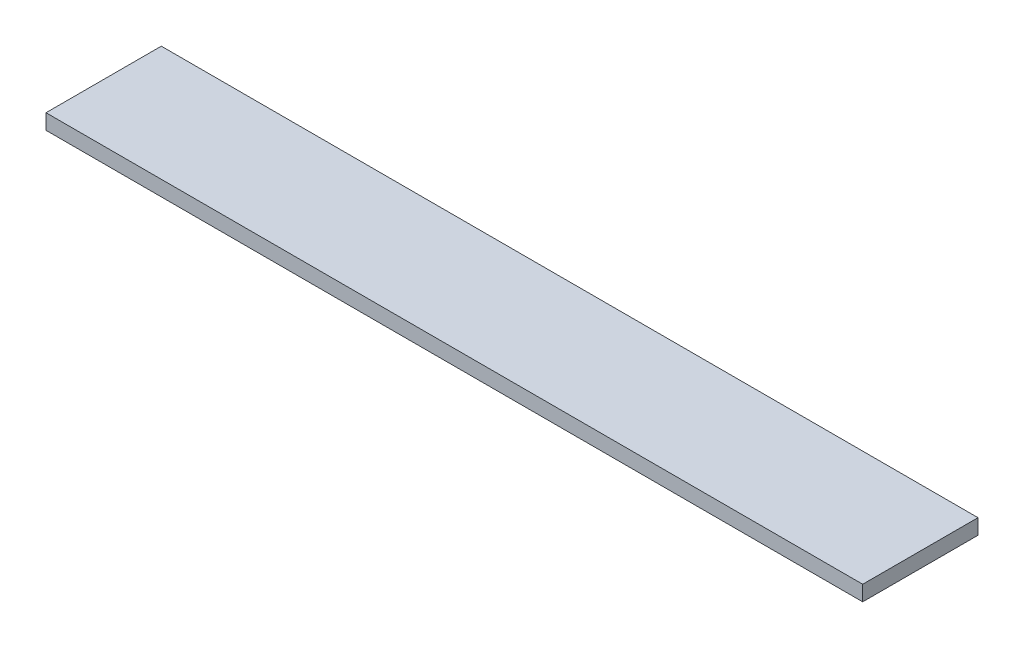
ISO-10303-21;
HEADER;
FILE_DESCRIPTION(('STEP AP214'),'2;1');
FILE_NAME('part.step','',(''),(''),'','','');
FILE_SCHEMA(('AUTOMOTIVE_DESIGN { 1 0 10303 214 1 1 1 1 }'));
ENDSEC;
DATA;
#1=APPLICATION_CONTEXT('core data for automotive mechanical design processes');
#2=APPLICATION_PROTOCOL_DEFINITION('international standard','automotive_design',2000,#1);
#3=PRODUCT_CONTEXT('',#1,'mechanical');
#4=PRODUCT('Part','Part','',(#3));
#5=PRODUCT_RELATED_PRODUCT_CATEGORY('part','',(#4));
#6=PRODUCT_DEFINITION_FORMATION('','',#4);
#7=PRODUCT_DEFINITION_CONTEXT('part definition',#1,'design');
#8=PRODUCT_DEFINITION('design','',#6,#7);
#9=PRODUCT_DEFINITION_SHAPE('','',#8);
#10=(LENGTH_UNIT() NAMED_UNIT(*) SI_UNIT(.MILLI.,.METRE.));
#11=(NAMED_UNIT(*) PLANE_ANGLE_UNIT() SI_UNIT($,.RADIAN.));
#12=(NAMED_UNIT(*) SI_UNIT($,.STERADIAN.) SOLID_ANGLE_UNIT());
#13=UNCERTAINTY_MEASURE_WITH_UNIT(LENGTH_MEASURE(1.E-05),#10,'distance_accuracy_value','');
#14=(GEOMETRIC_REPRESENTATION_CONTEXT(3) GLOBAL_UNCERTAINTY_ASSIGNED_CONTEXT((#13)) GLOBAL_UNIT_ASSIGNED_CONTEXT((#10,
#11,#12)) REPRESENTATION_CONTEXT('',''));
#15=CARTESIAN_POINT('',(0.,0.,0.));
#16=DIRECTION('',(0.,0.,1.));
#17=DIRECTION('',(1.,0.,0.));
#18=AXIS2_PLACEMENT_3D('',#15,#16,#17);
#19=CARTESIAN_POINT('',(42.5,1.5875,6.));
#20=DIRECTION('',(-1.,0.,0.));
#21=DIRECTION('',(0.,0.,1.));
#22=AXIS2_PLACEMENT_3D('',#19,#20,#21);
#23=PLANE('',#22);
#24=DIRECTION('',(0.,0.,-1.));
#25=VECTOR('',#24,1.);
#26=CARTESIAN_POINT('',(42.5,0.,6.));
#27=LINE('',#26,#25);
#28=CARTESIAN_POINT('',(42.5,0.,6.));
#29=VERTEX_POINT('',#28);
#30=CARTESIAN_POINT('',(42.5,0.,-6.));
#31=VERTEX_POINT('',#30);
#32=EDGE_CURVE('E98',#29,#31,#27,.T.);
#33=ORIENTED_EDGE('',*,*,#32,.T.);
#34=DIRECTION('',(0.,-1.,0.));
#35=VECTOR('',#34,1.);
#36=CARTESIAN_POINT('',(42.5,1.5875,-6.));
#37=LINE('',#36,#35);
#38=CARTESIAN_POINT('',(42.5,1.5875,-6.));
#39=VERTEX_POINT('',#38);
#40=EDGE_CURVE('E11',#39,#31,#37,.T.);
#41=ORIENTED_EDGE('',*,*,#40,.F.);
#42=DIRECTION('',(0.,0.,-1.));
#43=VECTOR('',#42,1.);
#44=CARTESIAN_POINT('',(42.5,1.5875,6.));
#45=LINE('',#44,#43);
#46=CARTESIAN_POINT('',(42.5,1.5875,6.));
#47=VERTEX_POINT('',#46);
#48=EDGE_CURVE('E86',#47,#39,#45,.T.);
#49=ORIENTED_EDGE('',*,*,#48,.F.);
#50=DIRECTION('',(0.,-1.,0.));
#51=VECTOR('',#50,1.);
#52=CARTESIAN_POINT('',(42.5,1.5875,6.));
#53=LINE('',#52,#51);
#54=EDGE_CURVE('E94',#47,#29,#53,.T.);
#55=ORIENTED_EDGE('',*,*,#54,.T.);
#56=EDGE_LOOP('',(#33,#41,#49,#55));
#57=FACE_BOUND('',#56,.T.);
#58=ADVANCED_FACE('F35',(#57),#23,.F.);
#59=CARTESIAN_POINT('',(-42.5,1.5875,-6.));
#60=DIRECTION('',(0.,0.,1.));
#61=DIRECTION('',(1.,0.,0.));
#62=AXIS2_PLACEMENT_3D('',#59,#60,#61);
#63=PLANE('',#62);
#64=DIRECTION('',(-1.,0.,0.));
#65=VECTOR('',#64,1.);
#66=CARTESIAN_POINT('',(-42.5,0.,-6.));
#67=LINE('',#66,#65);
#68=CARTESIAN_POINT('',(-42.5,0.,-6.));
#69=VERTEX_POINT('',#68);
#70=EDGE_CURVE('E90',#31,#69,#67,.T.);
#71=ORIENTED_EDGE('',*,*,#70,.T.);
#72=DIRECTION('',(0.,-1.,0.));
#73=VECTOR('',#72,1.);
#74=CARTESIAN_POINT('',(-42.5,1.5875,-6.));
#75=LINE('',#74,#73);
#76=CARTESIAN_POINT('',(-42.5,1.5875,-6.));
#77=VERTEX_POINT('',#76);
#78=EDGE_CURVE('E43',#77,#69,#75,.T.);
#79=ORIENTED_EDGE('',*,*,#78,.F.);
#80=DIRECTION('',(-1.,0.,0.));
#81=VECTOR('',#80,1.);
#82=CARTESIAN_POINT('',(-42.5,1.5875,-6.));
#83=LINE('',#82,#81);
#84=EDGE_CURVE('E81',#39,#77,#83,.T.);
#85=ORIENTED_EDGE('',*,*,#84,.F.);
#86=ORIENTED_EDGE('',*,*,#40,.T.);
#87=EDGE_LOOP('',(#71,#79,#85,#86));
#88=FACE_BOUND('',#87,.T.);
#89=ADVANCED_FACE('F89',(#88),#63,.F.);
#90=CARTESIAN_POINT('',(-42.5,1.5875,6.));
#91=DIRECTION('',(1.,0.,0.));
#92=DIRECTION('',(0.,0.,-1.));
#93=AXIS2_PLACEMENT_3D('',#90,#91,#92);
#94=PLANE('',#93);
#95=DIRECTION('',(0.,0.,1.));
#96=VECTOR('',#95,1.);
#97=CARTESIAN_POINT('',(-42.5,0.,6.));
#98=LINE('',#97,#96);
#99=CARTESIAN_POINT('',(-42.5,0.,6.));
#100=VERTEX_POINT('',#99);
#101=EDGE_CURVE('E68',#69,#100,#98,.T.);
#102=ORIENTED_EDGE('',*,*,#101,.T.);
#103=DIRECTION('',(0.,-1.,0.));
#104=VECTOR('',#103,1.);
#105=CARTESIAN_POINT('',(-42.5,1.5875,6.));
#106=LINE('',#105,#104);
#107=CARTESIAN_POINT('',(-42.5,1.5875,6.));
#108=VERTEX_POINT('',#107);
#109=EDGE_CURVE('E91',#108,#100,#106,.T.);
#110=ORIENTED_EDGE('',*,*,#109,.F.);
#111=DIRECTION('',(0.,0.,1.));
#112=VECTOR('',#111,1.);
#113=CARTESIAN_POINT('',(-42.5,1.5875,6.));
#114=LINE('',#113,#112);
#115=EDGE_CURVE('E84',#77,#108,#114,.T.);
#116=ORIENTED_EDGE('',*,*,#115,.F.);
#117=ORIENTED_EDGE('',*,*,#78,.T.);
#118=EDGE_LOOP('',(#102,#110,#116,#117));
#119=FACE_BOUND('',#118,.T.);
#120=ADVANCED_FACE('F92',(#119),#94,.F.);
#121=CARTESIAN_POINT('',(-42.5,1.5875,6.));
#122=DIRECTION('',(0.,0.,-1.));
#123=DIRECTION('',(-1.,0.,0.));
#124=AXIS2_PLACEMENT_3D('',#121,#122,#123);
#125=PLANE('',#124);
#126=DIRECTION('',(1.,0.,0.));
#127=VECTOR('',#126,1.);
#128=CARTESIAN_POINT('',(-42.5,0.,6.));
#129=LINE('',#128,#127);
#130=EDGE_CURVE('E74',#100,#29,#129,.T.);
#131=ORIENTED_EDGE('',*,*,#130,.T.);
#132=ORIENTED_EDGE('',*,*,#54,.F.);
#133=DIRECTION('',(1.,0.,0.));
#134=VECTOR('',#133,1.);
#135=CARTESIAN_POINT('',(-42.5,1.5875,6.));
#136=LINE('',#135,#134);
#137=EDGE_CURVE('E51',#108,#47,#136,.T.);
#138=ORIENTED_EDGE('',*,*,#137,.F.);
#139=ORIENTED_EDGE('',*,*,#109,.T.);
#140=EDGE_LOOP('',(#131,#132,#138,#139));
#141=FACE_BOUND('',#140,.T.);
#142=ADVANCED_FACE('F105',(#141),#125,.F.);
#143=CARTESIAN_POINT('',(0.,1.5875,0.));
#144=DIRECTION('',(0.,-1.,0.));
#145=DIRECTION('',(0.,0.,-1.));
#146=AXIS2_PLACEMENT_3D('',#143,#144,#145);
#147=PLANE('',#146);
#148=ORIENTED_EDGE('',*,*,#48,.T.);
#149=ORIENTED_EDGE('',*,*,#84,.T.);
#150=ORIENTED_EDGE('',*,*,#115,.T.);
#151=ORIENTED_EDGE('',*,*,#137,.T.);
#152=EDGE_LOOP('',(#148,#149,#150,#151));
#153=FACE_BOUND('',#152,.T.);
#154=ADVANCED_FACE('F82',(#153),#147,.F.);
#155=CARTESIAN_POINT('',(0.,0.,0.));
#156=DIRECTION('',(0.,-1.,0.));
#157=DIRECTION('',(0.,0.,-1.));
#158=AXIS2_PLACEMENT_3D('',#155,#156,#157);
#159=PLANE('',#158);
#160=ORIENTED_EDGE('',*,*,#32,.F.);
#161=ORIENTED_EDGE('',*,*,#130,.F.);
#162=ORIENTED_EDGE('',*,*,#101,.F.);
#163=ORIENTED_EDGE('',*,*,#70,.F.);
#164=EDGE_LOOP('',(#160,#161,#162,#163));
#165=FACE_BOUND('',#164,.T.);
#166=ADVANCED_FACE('F108',(#165),#159,.T.);
#167=CLOSED_SHELL('',(#58,#89,#120,#142,#154,#166));
#168=MANIFOLD_SOLID_BREP('B2',#167);
#169=ADVANCED_BREP_SHAPE_REPRESENTATION('',(#18,#168),#14);
#170=SHAPE_DEFINITION_REPRESENTATION(#9,#169);
ENDSEC;
END-ISO-10303-21;
